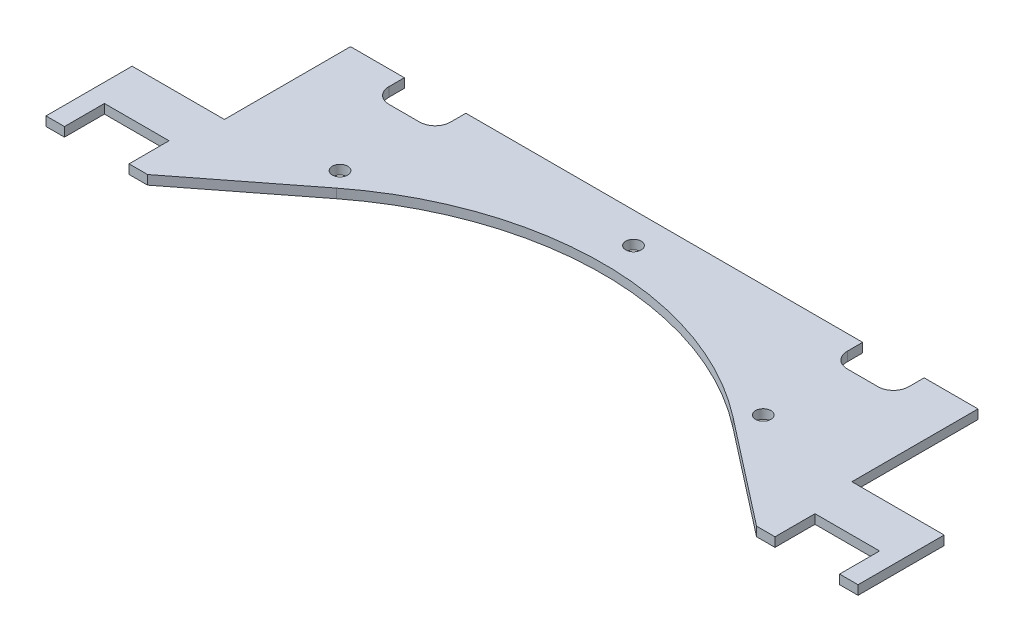
ISO-10303-21;
HEADER;
FILE_DESCRIPTION(('STEP AP214'),'2;1');
FILE_NAME('part.step','',(''),(''),'','','');
FILE_SCHEMA(('AUTOMOTIVE_DESIGN { 1 0 10303 214 1 1 1 1 }'));
ENDSEC;
DATA;
#1=APPLICATION_CONTEXT('core data for automotive mechanical design processes');
#2=APPLICATION_PROTOCOL_DEFINITION('international standard','automotive_design',2000,#1);
#3=PRODUCT_CONTEXT('',#1,'mechanical');
#4=PRODUCT('Part','Part','',(#3));
#5=PRODUCT_RELATED_PRODUCT_CATEGORY('part','',(#4));
#6=PRODUCT_DEFINITION_FORMATION('','',#4);
#7=PRODUCT_DEFINITION_CONTEXT('part definition',#1,'design');
#8=PRODUCT_DEFINITION('design','',#6,#7);
#9=PRODUCT_DEFINITION_SHAPE('','',#8);
#10=(LENGTH_UNIT() NAMED_UNIT(*) SI_UNIT(.MILLI.,.METRE.));
#11=(NAMED_UNIT(*) PLANE_ANGLE_UNIT() SI_UNIT($,.RADIAN.));
#12=(NAMED_UNIT(*) SI_UNIT($,.STERADIAN.) SOLID_ANGLE_UNIT());
#13=UNCERTAINTY_MEASURE_WITH_UNIT(LENGTH_MEASURE(1.E-05),#10,'distance_accuracy_value','');
#14=(GEOMETRIC_REPRESENTATION_CONTEXT(3) GLOBAL_UNCERTAINTY_ASSIGNED_CONTEXT((#13)) GLOBAL_UNIT_ASSIGNED_CONTEXT((#10,
#11,#12)) REPRESENTATION_CONTEXT('',''));
#15=CARTESIAN_POINT('',(0.,0.,0.));
#16=DIRECTION('',(0.,0.,1.));
#17=DIRECTION('',(1.,0.,0.));
#18=AXIS2_PLACEMENT_3D('',#15,#16,#17);
#19=CARTESIAN_POINT('',(0.,3.,30.));
#20=DIRECTION('',(0.,1.,0.));
#21=DIRECTION('',(0.,0.,1.));
#22=AXIS2_PLACEMENT_3D('',#19,#20,#21);
#23=PLANE('',#22);
#24=CARTESIAN_POINT('',(68.7939924130601,3.,-58.3820491269117));
#25=DIRECTION('',(0.,1.,0.));
#26=DIRECTION('',(0.,0.,-1.));
#27=AXIS2_PLACEMENT_3D('',#24,#25,#26);
#28=CIRCLE('',#27,2.50000000000001);
#29=CARTESIAN_POINT('',(68.7939924130601,3.,-60.8820491269117));
#30=VERTEX_POINT('',#29);
#31=EDGE_CURVE('E545',#30,#30,#28,.T.);
#32=ORIENTED_EDGE('',*,*,#31,.F.);
#33=EDGE_LOOP('',(#32));
#34=FACE_BOUND('',#33,.T.);
#35=CARTESIAN_POINT('',(0.,3.,30.));
#36=DIRECTION('',(0.,-1.,0.));
#37=DIRECTION('',(0.,0.,1.));
#38=AXIS2_PLACEMENT_3D('',#35,#36,#37);
#39=CIRCLE('',#38,105.);
#40=CARTESIAN_POINT('',(-64.4943678872438,3.,-52.8581710564798));
#41=VERTEX_POINT('',#40);
#42=CARTESIAN_POINT('',(64.4943678872438,3.,-52.8581710564798));
#43=VERTEX_POINT('',#42);
#44=EDGE_CURVE('E335',#41,#43,#39,.T.);
#45=ORIENTED_EDGE('',*,*,#44,.T.);
#46=DIRECTION('',(0.78912543863314,0.,0.614232075116607));
#47=VECTOR('',#46,1.);
#48=CARTESIAN_POINT('',(64.4943678872438,3.,-52.8581710564798));
#49=LINE('',#48,#47);
#50=CARTESIAN_POINT('',(99.,3.,-26.));
#51=VERTEX_POINT('',#50);
#52=EDGE_CURVE('E163',#43,#51,#49,.T.);
#53=ORIENTED_EDGE('',*,*,#52,.T.);
#54=DIRECTION('',(1.,0.,0.));
#55=VECTOR('',#54,1.);
#56=CARTESIAN_POINT('',(105.,3.,-26.));
#57=LINE('',#56,#55);
#58=CARTESIAN_POINT('',(105.,3.,-26.));
#59=VERTEX_POINT('',#58);
#60=EDGE_CURVE('E422',#51,#59,#57,.T.);
#61=ORIENTED_EDGE('',*,*,#60,.T.);
#62=DIRECTION('',(0.,0.,-1.));
#63=VECTOR('',#62,1.);
#64=CARTESIAN_POINT('',(105.,3.,-39.));
#65=LINE('',#64,#63);
#66=CARTESIAN_POINT('',(105.,3.,-39.));
#67=VERTEX_POINT('',#66);
#68=EDGE_CURVE('E441',#59,#67,#65,.T.);
#69=ORIENTED_EDGE('',*,*,#68,.T.);
#70=DIRECTION('',(1.,0.,0.));
#71=VECTOR('',#70,1.);
#72=CARTESIAN_POINT('',(126.,3.,-39.));
#73=LINE('',#72,#71);
#74=CARTESIAN_POINT('',(126.,3.,-39.));
#75=VERTEX_POINT('',#74);
#76=EDGE_CURVE('E438',#67,#75,#73,.T.);
#77=ORIENTED_EDGE('',*,*,#76,.T.);
#78=DIRECTION('',(0.,0.,1.));
#79=VECTOR('',#78,1.);
#80=CARTESIAN_POINT('',(126.,3.,-26.));
#81=LINE('',#80,#79);
#82=CARTESIAN_POINT('',(126.,3.,-26.));
#83=VERTEX_POINT('',#82);
#84=EDGE_CURVE('E440',#75,#83,#81,.T.);
#85=ORIENTED_EDGE('',*,*,#84,.T.);
#86=DIRECTION('',(1.,0.,0.));
#87=VECTOR('',#86,1.);
#88=CARTESIAN_POINT('',(132.,3.,-26.));
#89=LINE('',#88,#87);
#90=CARTESIAN_POINT('',(132.,3.,-26.));
#91=VERTEX_POINT('',#90);
#92=EDGE_CURVE('E443',#83,#91,#89,.T.);
#93=ORIENTED_EDGE('',*,*,#92,.T.);
#94=DIRECTION('',(0.,0.,-1.));
#95=VECTOR('',#94,1.);
#96=CARTESIAN_POINT('',(132.,3.,-26.));
#97=LINE('',#96,#95);
#98=CARTESIAN_POINT('',(132.,3.,-54.));
#99=VERTEX_POINT('',#98);
#100=EDGE_CURVE('E449',#91,#99,#97,.T.);
#101=ORIENTED_EDGE('',*,*,#100,.T.);
#102=DIRECTION('',(-1.,0.,0.));
#103=VECTOR('',#102,1.);
#104=CARTESIAN_POINT('',(132.,3.,-54.));
#105=LINE('',#104,#103);
#106=CARTESIAN_POINT('',(102.,3.,-54.));
#107=VERTEX_POINT('',#106);
#108=EDGE_CURVE('E451',#99,#107,#105,.T.);
#109=ORIENTED_EDGE('',*,*,#108,.T.);
#110=DIRECTION('',(0.,0.,-1.));
#111=VECTOR('',#110,1.);
#112=CARTESIAN_POINT('',(102.,3.,-54.));
#113=LINE('',#112,#111);
#114=CARTESIAN_POINT('',(102.,3.,-95.));
#115=VERTEX_POINT('',#114);
#116=EDGE_CURVE('E453',#107,#115,#113,.T.);
#117=ORIENTED_EDGE('',*,*,#116,.T.);
#118=DIRECTION('',(-1.,0.,0.));
#119=VECTOR('',#118,1.);
#120=CARTESIAN_POINT('',(102.,3.,-95.));
#121=LINE('',#120,#119);
#122=CARTESIAN_POINT('',(84.5,3.,-95.));
#123=VERTEX_POINT('',#122);
#124=EDGE_CURVE('E455',#115,#123,#121,.T.);
#125=ORIENTED_EDGE('',*,*,#124,.T.);
#126=DIRECTION('',(0.,0.,1.));
#127=VECTOR('',#126,1.);
#128=CARTESIAN_POINT('',(84.5,3.,-95.));
#129=LINE('',#128,#127);
#130=CARTESIAN_POINT('',(84.5,3.,-90.));
#131=VERTEX_POINT('',#130);
#132=EDGE_CURVE('E457',#123,#131,#129,.T.);
#133=ORIENTED_EDGE('',*,*,#132,.T.);
#134=CARTESIAN_POINT('',(79.5,3.,-90.));
#135=DIRECTION('',(0.,-1.,0.));
#136=DIRECTION('',(0.,0.,-1.));
#137=AXIS2_PLACEMENT_3D('',#134,#135,#136);
#138=CIRCLE('',#137,5.);
#139=CARTESIAN_POINT('',(79.5,3.,-85.));
#140=VERTEX_POINT('',#139);
#141=EDGE_CURVE('E459',#131,#140,#138,.T.);
#142=ORIENTED_EDGE('',*,*,#141,.T.);
#143=DIRECTION('',(-1.,0.,0.));
#144=VECTOR('',#143,1.);
#145=CARTESIAN_POINT('',(79.5,3.,-85.));
#146=LINE('',#145,#144);
#147=CARTESIAN_POINT('',(69.5,3.,-85.));
#148=VERTEX_POINT('',#147);
#149=EDGE_CURVE('E461',#140,#148,#146,.T.);
#150=ORIENTED_EDGE('',*,*,#149,.T.);
#151=CARTESIAN_POINT('',(69.5,3.,-90.));
#152=DIRECTION('',(0.,-1.,0.));
#153=DIRECTION('',(0.,0.,-1.));
#154=AXIS2_PLACEMENT_3D('',#151,#152,#153);
#155=CIRCLE('',#154,5.);
#156=CARTESIAN_POINT('',(64.5,3.,-90.));
#157=VERTEX_POINT('',#156);
#158=EDGE_CURVE('E463',#148,#157,#155,.T.);
#159=ORIENTED_EDGE('',*,*,#158,.T.);
#160=DIRECTION('',(0.,0.,-1.));
#161=VECTOR('',#160,1.);
#162=CARTESIAN_POINT('',(64.5,3.,-95.));
#163=LINE('',#162,#161);
#164=CARTESIAN_POINT('',(64.5,3.,-95.));
#165=VERTEX_POINT('',#164);
#166=EDGE_CURVE('E465',#157,#165,#163,.T.);
#167=ORIENTED_EDGE('',*,*,#166,.T.);
#168=DIRECTION('',(-1.,0.,0.));
#169=VECTOR('',#168,1.);
#170=CARTESIAN_POINT('',(-64.5,3.,-95.));
#171=LINE('',#170,#169);
#172=CARTESIAN_POINT('',(-64.5,3.,-95.));
#173=VERTEX_POINT('',#172);
#174=EDGE_CURVE('E467',#165,#173,#171,.T.);
#175=ORIENTED_EDGE('',*,*,#174,.T.);
#176=DIRECTION('',(0.,0.,1.));
#177=VECTOR('',#176,1.);
#178=CARTESIAN_POINT('',(-64.5,3.,-95.));
#179=LINE('',#178,#177);
#180=CARTESIAN_POINT('',(-64.5,3.,-90.));
#181=VERTEX_POINT('',#180);
#182=EDGE_CURVE('E469',#173,#181,#179,.T.);
#183=ORIENTED_EDGE('',*,*,#182,.T.);
#184=CARTESIAN_POINT('',(-69.5,3.,-90.));
#185=DIRECTION('',(0.,-1.,0.));
#186=DIRECTION('',(0.,0.,1.));
#187=AXIS2_PLACEMENT_3D('',#184,#185,#186);
#188=CIRCLE('',#187,5.);
#189=CARTESIAN_POINT('',(-69.5,3.,-85.));
#190=VERTEX_POINT('',#189);
#191=EDGE_CURVE('E471',#181,#190,#188,.T.);
#192=ORIENTED_EDGE('',*,*,#191,.T.);
#193=DIRECTION('',(-1.,0.,0.));
#194=VECTOR('',#193,1.);
#195=CARTESIAN_POINT('',(-79.5,3.,-85.));
#196=LINE('',#195,#194);
#197=CARTESIAN_POINT('',(-79.5,3.,-85.));
#198=VERTEX_POINT('',#197);
#199=EDGE_CURVE('E473',#190,#198,#196,.T.);
#200=ORIENTED_EDGE('',*,*,#199,.T.);
#201=CARTESIAN_POINT('',(-79.5,3.,-90.));
#202=DIRECTION('',(0.,-1.,0.));
#203=DIRECTION('',(0.,0.,1.));
#204=AXIS2_PLACEMENT_3D('',#201,#202,#203);
#205=CIRCLE('',#204,5.);
#206=CARTESIAN_POINT('',(-84.5,3.,-90.));
#207=VERTEX_POINT('',#206);
#208=EDGE_CURVE('E475',#198,#207,#205,.T.);
#209=ORIENTED_EDGE('',*,*,#208,.T.);
#210=DIRECTION('',(0.,0.,-1.));
#211=VECTOR('',#210,1.);
#212=CARTESIAN_POINT('',(-84.5,3.,-95.));
#213=LINE('',#212,#211);
#214=CARTESIAN_POINT('',(-84.5,3.,-95.));
#215=VERTEX_POINT('',#214);
#216=EDGE_CURVE('E477',#207,#215,#213,.T.);
#217=ORIENTED_EDGE('',*,*,#216,.T.);
#218=DIRECTION('',(-1.,0.,0.));
#219=VECTOR('',#218,1.);
#220=CARTESIAN_POINT('',(-102.,3.,-95.));
#221=LINE('',#220,#219);
#222=CARTESIAN_POINT('',(-102.,3.,-95.));
#223=VERTEX_POINT('',#222);
#224=EDGE_CURVE('E479',#215,#223,#221,.T.);
#225=ORIENTED_EDGE('',*,*,#224,.T.);
#226=DIRECTION('',(0.,0.,1.));
#227=VECTOR('',#226,1.);
#228=CARTESIAN_POINT('',(-102.,3.,-54.));
#229=LINE('',#228,#227);
#230=CARTESIAN_POINT('',(-102.,3.,-54.));
#231=VERTEX_POINT('',#230);
#232=EDGE_CURVE('E481',#223,#231,#229,.T.);
#233=ORIENTED_EDGE('',*,*,#232,.T.);
#234=DIRECTION('',(-1.,0.,0.));
#235=VECTOR('',#234,1.);
#236=CARTESIAN_POINT('',(-132.,3.,-54.));
#237=LINE('',#236,#235);
#238=CARTESIAN_POINT('',(-132.,3.,-54.));
#239=VERTEX_POINT('',#238);
#240=EDGE_CURVE('E483',#231,#239,#237,.T.);
#241=ORIENTED_EDGE('',*,*,#240,.T.);
#242=DIRECTION('',(0.,0.,1.));
#243=VECTOR('',#242,1.);
#244=CARTESIAN_POINT('',(-132.,3.,-26.));
#245=LINE('',#244,#243);
#246=CARTESIAN_POINT('',(-132.,3.,-26.));
#247=VERTEX_POINT('',#246);
#248=EDGE_CURVE('E485',#239,#247,#245,.T.);
#249=ORIENTED_EDGE('',*,*,#248,.T.);
#250=DIRECTION('',(1.,0.,0.));
#251=VECTOR('',#250,1.);
#252=CARTESIAN_POINT('',(-132.,3.,-26.));
#253=LINE('',#252,#251);
#254=CARTESIAN_POINT('',(-126.,3.,-26.));
#255=VERTEX_POINT('',#254);
#256=EDGE_CURVE('E487',#247,#255,#253,.T.);
#257=ORIENTED_EDGE('',*,*,#256,.T.);
#258=DIRECTION('',(0.,0.,-1.));
#259=VECTOR('',#258,1.);
#260=CARTESIAN_POINT('',(-126.,3.,-26.));
#261=LINE('',#260,#259);
#262=CARTESIAN_POINT('',(-126.,3.,-39.));
#263=VERTEX_POINT('',#262);
#264=EDGE_CURVE('E489',#255,#263,#261,.T.);
#265=ORIENTED_EDGE('',*,*,#264,.T.);
#266=DIRECTION('',(1.,0.,0.));
#267=VECTOR('',#266,1.);
#268=CARTESIAN_POINT('',(-126.,3.,-39.));
#269=LINE('',#268,#267);
#270=CARTESIAN_POINT('',(-105.,3.,-39.));
#271=VERTEX_POINT('',#270);
#272=EDGE_CURVE('E254',#263,#271,#269,.T.);
#273=ORIENTED_EDGE('',*,*,#272,.T.);
#274=DIRECTION('',(0.,0.,1.));
#275=VECTOR('',#274,1.);
#276=CARTESIAN_POINT('',(-105.,3.,-39.));
#277=LINE('',#276,#275);
#278=CARTESIAN_POINT('',(-105.,3.,-26.));
#279=VERTEX_POINT('',#278);
#280=EDGE_CURVE('E248',#271,#279,#277,.T.);
#281=ORIENTED_EDGE('',*,*,#280,.T.);
#282=DIRECTION('',(1.,0.,0.));
#283=VECTOR('',#282,1.);
#284=CARTESIAN_POINT('',(-105.,3.,-26.));
#285=LINE('',#284,#283);
#286=CARTESIAN_POINT('',(-99.,3.,-26.));
#287=VERTEX_POINT('',#286);
#288=EDGE_CURVE('E252',#279,#287,#285,.T.);
#289=ORIENTED_EDGE('',*,*,#288,.T.);
#290=DIRECTION('',(0.78912543863314,0.,-0.614232075116607));
#291=VECTOR('',#290,1.);
#292=CARTESIAN_POINT('',(-64.4943678872438,3.,-52.8581710564798));
#293=LINE('',#292,#291);
#294=EDGE_CURVE('E48',#287,#41,#293,.T.);
#295=ORIENTED_EDGE('',*,*,#294,.T.);
#296=EDGE_LOOP('',(#45,#53,#61,#69,#77,#85,#93,#101,#109,#117,#125,#133,#142,#150,#159,#167,
#175,#183,#192,#200,#209,#217,#225,#233,#241,#249,#257,#265,#273,#281,#289,#295));
#297=FACE_BOUND('',#296,.T.);
#298=CARTESIAN_POINT('',(-68.7939924130601,3.,-58.3820491269117));
#299=DIRECTION('',(0.,1.,0.));
#300=DIRECTION('',(0.,0.,1.));
#301=AXIS2_PLACEMENT_3D('',#298,#299,#300);
#302=CIRCLE('',#301,2.50000000000001);
#303=CARTESIAN_POINT('',(-68.7939924130601,3.,-55.8820491269117));
#304=VERTEX_POINT('',#303);
#305=EDGE_CURVE('E276',#304,#304,#302,.T.);
#306=ORIENTED_EDGE('',*,*,#305,.F.);
#307=EDGE_LOOP('',(#306));
#308=FACE_BOUND('',#307,.T.);
#309=CARTESIAN_POINT('',(0.,3.,-85.));
#310=DIRECTION('',(0.,1.,0.));
#311=DIRECTION('',(0.,0.,1.));
#312=AXIS2_PLACEMENT_3D('',#309,#310,#311);
#313=CIRCLE('',#312,2.5);
#314=CARTESIAN_POINT('',(0.,3.,-82.5));
#315=VERTEX_POINT('',#314);
#316=EDGE_CURVE('E536',#315,#315,#313,.T.);
#317=ORIENTED_EDGE('',*,*,#316,.F.);
#318=EDGE_LOOP('',(#317));
#319=FACE_BOUND('',#318,.T.);
#320=ADVANCED_FACE('F31',(#34,#297,#308,#319),#23,.T.);
#321=CARTESIAN_POINT('',(0.,0.,30.));
#322=DIRECTION('',(0.,1.,0.));
#323=DIRECTION('',(0.,0.,1.));
#324=AXIS2_PLACEMENT_3D('',#321,#322,#323);
#325=PLANE('',#324);
#326=CARTESIAN_POINT('',(68.7939924130601,0.,-58.3820491269117));
#327=DIRECTION('',(0.,1.,0.));
#328=DIRECTION('',(0.,0.,-1.));
#329=AXIS2_PLACEMENT_3D('',#326,#327,#328);
#330=CIRCLE('',#329,2.50000000000001);
#331=CARTESIAN_POINT('',(68.7939924130601,0.,-60.8820491269117));
#332=VERTEX_POINT('',#331);
#333=EDGE_CURVE('E542',#332,#332,#330,.T.);
#334=ORIENTED_EDGE('',*,*,#333,.T.);
#335=EDGE_LOOP('',(#334));
#336=FACE_BOUND('',#335,.T.);
#337=CARTESIAN_POINT('',(0.,0.,30.));
#338=DIRECTION('',(0.,-1.,0.));
#339=DIRECTION('',(0.,0.,1.));
#340=AXIS2_PLACEMENT_3D('',#337,#338,#339);
#341=CIRCLE('',#340,105.);
#342=CARTESIAN_POINT('',(-64.4943678872438,0.,-52.8581710564798));
#343=VERTEX_POINT('',#342);
#344=CARTESIAN_POINT('',(64.4943678872438,0.,-52.8581710564798));
#345=VERTEX_POINT('',#344);
#346=EDGE_CURVE('E272',#343,#345,#341,.T.);
#347=ORIENTED_EDGE('',*,*,#346,.F.);
#348=DIRECTION('',(0.78912543863314,0.,-0.614232075116607));
#349=VECTOR('',#348,1.);
#350=CARTESIAN_POINT('',(-64.4943678872438,0.,-52.8581710564798));
#351=LINE('',#350,#349);
#352=CARTESIAN_POINT('',(-99.,0.,-26.));
#353=VERTEX_POINT('',#352);
#354=EDGE_CURVE('E155',#353,#343,#351,.T.);
#355=ORIENTED_EDGE('',*,*,#354,.F.);
#356=DIRECTION('',(1.,0.,0.));
#357=VECTOR('',#356,1.);
#358=CARTESIAN_POINT('',(-105.,0.,-26.));
#359=LINE('',#358,#357);
#360=CARTESIAN_POINT('',(-105.,0.,-26.));
#361=VERTEX_POINT('',#360);
#362=EDGE_CURVE('E149',#361,#353,#359,.T.);
#363=ORIENTED_EDGE('',*,*,#362,.F.);
#364=DIRECTION('',(0.,0.,1.));
#365=VECTOR('',#364,1.);
#366=CARTESIAN_POINT('',(-105.,0.,-39.));
#367=LINE('',#366,#365);
#368=CARTESIAN_POINT('',(-105.,0.,-39.));
#369=VERTEX_POINT('',#368);
#370=EDGE_CURVE('E262',#369,#361,#367,.T.);
#371=ORIENTED_EDGE('',*,*,#370,.F.);
#372=DIRECTION('',(1.,0.,0.));
#373=VECTOR('',#372,1.);
#374=CARTESIAN_POINT('',(-126.,0.,-39.));
#375=LINE('',#374,#373);
#376=CARTESIAN_POINT('',(-126.,0.,-39.));
#377=VERTEX_POINT('',#376);
#378=EDGE_CURVE('E330',#377,#369,#375,.T.);
#379=ORIENTED_EDGE('',*,*,#378,.F.);
#380=DIRECTION('',(0.,0.,-1.));
#381=VECTOR('',#380,1.);
#382=CARTESIAN_POINT('',(-126.,0.,-26.));
#383=LINE('',#382,#381);
#384=CARTESIAN_POINT('',(-126.,0.,-26.));
#385=VERTEX_POINT('',#384);
#386=EDGE_CURVE('E328',#385,#377,#383,.T.);
#387=ORIENTED_EDGE('',*,*,#386,.F.);
#388=DIRECTION('',(1.,0.,0.));
#389=VECTOR('',#388,1.);
#390=CARTESIAN_POINT('',(-132.,0.,-26.));
#391=LINE('',#390,#389);
#392=CARTESIAN_POINT('',(-132.,0.,-26.));
#393=VERTEX_POINT('',#392);
#394=EDGE_CURVE('E326',#393,#385,#391,.T.);
#395=ORIENTED_EDGE('',*,*,#394,.F.);
#396=DIRECTION('',(0.,0.,1.));
#397=VECTOR('',#396,1.);
#398=CARTESIAN_POINT('',(-132.,0.,-26.));
#399=LINE('',#398,#397);
#400=CARTESIAN_POINT('',(-132.,0.,-54.));
#401=VERTEX_POINT('',#400);
#402=EDGE_CURVE('E324',#401,#393,#399,.T.);
#403=ORIENTED_EDGE('',*,*,#402,.F.);
#404=DIRECTION('',(-1.,0.,0.));
#405=VECTOR('',#404,1.);
#406=CARTESIAN_POINT('',(-132.,0.,-54.));
#407=LINE('',#406,#405);
#408=CARTESIAN_POINT('',(-102.,0.,-54.));
#409=VERTEX_POINT('',#408);
#410=EDGE_CURVE('E322',#409,#401,#407,.T.);
#411=ORIENTED_EDGE('',*,*,#410,.F.);
#412=DIRECTION('',(0.,0.,1.));
#413=VECTOR('',#412,1.);
#414=CARTESIAN_POINT('',(-102.,0.,-54.));
#415=LINE('',#414,#413);
#416=CARTESIAN_POINT('',(-102.,0.,-95.));
#417=VERTEX_POINT('',#416);
#418=EDGE_CURVE('E320',#417,#409,#415,.T.);
#419=ORIENTED_EDGE('',*,*,#418,.F.);
#420=DIRECTION('',(-1.,0.,0.));
#421=VECTOR('',#420,1.);
#422=CARTESIAN_POINT('',(-102.,0.,-95.));
#423=LINE('',#422,#421);
#424=CARTESIAN_POINT('',(-84.5,0.,-95.));
#425=VERTEX_POINT('',#424);
#426=EDGE_CURVE('E318',#425,#417,#423,.T.);
#427=ORIENTED_EDGE('',*,*,#426,.F.);
#428=DIRECTION('',(0.,0.,-1.));
#429=VECTOR('',#428,1.);
#430=CARTESIAN_POINT('',(-84.5,0.,-95.));
#431=LINE('',#430,#429);
#432=CARTESIAN_POINT('',(-84.5,0.,-90.));
#433=VERTEX_POINT('',#432);
#434=EDGE_CURVE('E316',#433,#425,#431,.T.);
#435=ORIENTED_EDGE('',*,*,#434,.F.);
#436=CARTESIAN_POINT('',(-79.5,0.,-90.));
#437=DIRECTION('',(0.,-1.,0.));
#438=DIRECTION('',(0.,0.,1.));
#439=AXIS2_PLACEMENT_3D('',#436,#437,#438);
#440=CIRCLE('',#439,5.);
#441=CARTESIAN_POINT('',(-79.5,0.,-85.));
#442=VERTEX_POINT('',#441);
#443=EDGE_CURVE('E314',#442,#433,#440,.T.);
#444=ORIENTED_EDGE('',*,*,#443,.F.);
#445=DIRECTION('',(-1.,0.,0.));
#446=VECTOR('',#445,1.);
#447=CARTESIAN_POINT('',(-79.5,0.,-85.));
#448=LINE('',#447,#446);
#449=CARTESIAN_POINT('',(-69.5,0.,-85.));
#450=VERTEX_POINT('',#449);
#451=EDGE_CURVE('E312',#450,#442,#448,.T.);
#452=ORIENTED_EDGE('',*,*,#451,.F.);
#453=CARTESIAN_POINT('',(-69.5,0.,-90.));
#454=DIRECTION('',(0.,-1.,0.));
#455=DIRECTION('',(0.,0.,1.));
#456=AXIS2_PLACEMENT_3D('',#453,#454,#455);
#457=CIRCLE('',#456,5.);
#458=CARTESIAN_POINT('',(-64.5,0.,-90.));
#459=VERTEX_POINT('',#458);
#460=EDGE_CURVE('E310',#459,#450,#457,.T.);
#461=ORIENTED_EDGE('',*,*,#460,.F.);
#462=DIRECTION('',(0.,0.,1.));
#463=VECTOR('',#462,1.);
#464=CARTESIAN_POINT('',(-64.5,0.,-95.));
#465=LINE('',#464,#463);
#466=CARTESIAN_POINT('',(-64.5,0.,-95.));
#467=VERTEX_POINT('',#466);
#468=EDGE_CURVE('E308',#467,#459,#465,.T.);
#469=ORIENTED_EDGE('',*,*,#468,.F.);
#470=DIRECTION('',(-1.,0.,0.));
#471=VECTOR('',#470,1.);
#472=CARTESIAN_POINT('',(-64.5,0.,-95.));
#473=LINE('',#472,#471);
#474=CARTESIAN_POINT('',(64.5,0.,-95.));
#475=VERTEX_POINT('',#474);
#476=EDGE_CURVE('E306',#475,#467,#473,.T.);
#477=ORIENTED_EDGE('',*,*,#476,.F.);
#478=DIRECTION('',(0.,0.,-1.));
#479=VECTOR('',#478,1.);
#480=CARTESIAN_POINT('',(64.5,0.,-95.));
#481=LINE('',#480,#479);
#482=CARTESIAN_POINT('',(64.5,0.,-90.));
#483=VERTEX_POINT('',#482);
#484=EDGE_CURVE('E304',#483,#475,#481,.T.);
#485=ORIENTED_EDGE('',*,*,#484,.F.);
#486=CARTESIAN_POINT('',(69.5,0.,-90.));
#487=DIRECTION('',(0.,-1.,0.));
#488=DIRECTION('',(0.,0.,-1.));
#489=AXIS2_PLACEMENT_3D('',#486,#487,#488);
#490=CIRCLE('',#489,5.);
#491=CARTESIAN_POINT('',(69.5,0.,-85.));
#492=VERTEX_POINT('',#491);
#493=EDGE_CURVE('E302',#492,#483,#490,.T.);
#494=ORIENTED_EDGE('',*,*,#493,.F.);
#495=DIRECTION('',(-1.,0.,0.));
#496=VECTOR('',#495,1.);
#497=CARTESIAN_POINT('',(79.5,0.,-85.));
#498=LINE('',#497,#496);
#499=CARTESIAN_POINT('',(79.5,0.,-85.));
#500=VERTEX_POINT('',#499);
#501=EDGE_CURVE('E300',#500,#492,#498,.T.);
#502=ORIENTED_EDGE('',*,*,#501,.F.);
#503=CARTESIAN_POINT('',(79.5,0.,-90.));
#504=DIRECTION('',(0.,-1.,0.));
#505=DIRECTION('',(0.,0.,-1.));
#506=AXIS2_PLACEMENT_3D('',#503,#504,#505);
#507=CIRCLE('',#506,5.);
#508=CARTESIAN_POINT('',(84.5,0.,-90.));
#509=VERTEX_POINT('',#508);
#510=EDGE_CURVE('E298',#509,#500,#507,.T.);
#511=ORIENTED_EDGE('',*,*,#510,.F.);
#512=DIRECTION('',(0.,0.,1.));
#513=VECTOR('',#512,1.);
#514=CARTESIAN_POINT('',(84.5,0.,-95.));
#515=LINE('',#514,#513);
#516=CARTESIAN_POINT('',(84.5,0.,-95.));
#517=VERTEX_POINT('',#516);
#518=EDGE_CURVE('E296',#517,#509,#515,.T.);
#519=ORIENTED_EDGE('',*,*,#518,.F.);
#520=DIRECTION('',(-1.,0.,0.));
#521=VECTOR('',#520,1.);
#522=CARTESIAN_POINT('',(102.,0.,-95.));
#523=LINE('',#522,#521);
#524=CARTESIAN_POINT('',(102.,0.,-95.));
#525=VERTEX_POINT('',#524);
#526=EDGE_CURVE('E294',#525,#517,#523,.T.);
#527=ORIENTED_EDGE('',*,*,#526,.F.);
#528=DIRECTION('',(0.,0.,-1.));
#529=VECTOR('',#528,1.);
#530=CARTESIAN_POINT('',(102.,0.,-54.));
#531=LINE('',#530,#529);
#532=CARTESIAN_POINT('',(102.,0.,-54.));
#533=VERTEX_POINT('',#532);
#534=EDGE_CURVE('E292',#533,#525,#531,.T.);
#535=ORIENTED_EDGE('',*,*,#534,.F.);
#536=DIRECTION('',(-1.,0.,0.));
#537=VECTOR('',#536,1.);
#538=CARTESIAN_POINT('',(132.,0.,-54.));
#539=LINE('',#538,#537);
#540=CARTESIAN_POINT('',(132.,0.,-54.));
#541=VERTEX_POINT('',#540);
#542=EDGE_CURVE('E290',#541,#533,#539,.T.);
#543=ORIENTED_EDGE('',*,*,#542,.F.);
#544=DIRECTION('',(0.,0.,-1.));
#545=VECTOR('',#544,1.);
#546=CARTESIAN_POINT('',(132.,0.,-26.));
#547=LINE('',#546,#545);
#548=CARTESIAN_POINT('',(132.,0.,-26.));
#549=VERTEX_POINT('',#548);
#550=EDGE_CURVE('E288',#549,#541,#547,.T.);
#551=ORIENTED_EDGE('',*,*,#550,.F.);
#552=DIRECTION('',(1.,0.,0.));
#553=VECTOR('',#552,1.);
#554=CARTESIAN_POINT('',(132.,0.,-26.));
#555=LINE('',#554,#553);
#556=CARTESIAN_POINT('',(126.,0.,-26.));
#557=VERTEX_POINT('',#556);
#558=EDGE_CURVE('E286',#557,#549,#555,.T.);
#559=ORIENTED_EDGE('',*,*,#558,.F.);
#560=DIRECTION('',(0.,0.,1.));
#561=VECTOR('',#560,1.);
#562=CARTESIAN_POINT('',(126.,0.,-26.));
#563=LINE('',#562,#561);
#564=CARTESIAN_POINT('',(126.,0.,-39.));
#565=VERTEX_POINT('',#564);
#566=EDGE_CURVE('E284',#565,#557,#563,.T.);
#567=ORIENTED_EDGE('',*,*,#566,.F.);
#568=DIRECTION('',(1.,0.,0.));
#569=VECTOR('',#568,1.);
#570=CARTESIAN_POINT('',(126.,0.,-39.));
#571=LINE('',#570,#569);
#572=CARTESIAN_POINT('',(105.,0.,-39.));
#573=VERTEX_POINT('',#572);
#574=EDGE_CURVE('E282',#573,#565,#571,.T.);
#575=ORIENTED_EDGE('',*,*,#574,.F.);
#576=DIRECTION('',(0.,0.,-1.));
#577=VECTOR('',#576,1.);
#578=CARTESIAN_POINT('',(105.,0.,-39.));
#579=LINE('',#578,#577);
#580=CARTESIAN_POINT('',(105.,0.,-26.));
#581=VERTEX_POINT('',#580);
#582=EDGE_CURVE('E280',#581,#573,#579,.T.);
#583=ORIENTED_EDGE('',*,*,#582,.F.);
#584=DIRECTION('',(1.,0.,0.));
#585=VECTOR('',#584,1.);
#586=CARTESIAN_POINT('',(105.,0.,-26.));
#587=LINE('',#586,#585);
#588=CARTESIAN_POINT('',(99.,0.,-26.));
#589=VERTEX_POINT('',#588);
#590=EDGE_CURVE('E278',#589,#581,#587,.T.);
#591=ORIENTED_EDGE('',*,*,#590,.F.);
#592=DIRECTION('',(0.78912543863314,0.,0.614232075116607));
#593=VECTOR('',#592,1.);
#594=CARTESIAN_POINT('',(64.4943678872438,0.,-52.8581710564798));
#595=LINE('',#594,#593);
#596=EDGE_CURVE('E275',#345,#589,#595,.T.);
#597=ORIENTED_EDGE('',*,*,#596,.F.);
#598=EDGE_LOOP('',(#347,#355,#363,#371,#379,#387,#395,#403,#411,#419,#427,#435,#444,#452,#461,
#469,#477,#485,#494,#502,#511,#519,#527,#535,#543,#551,#559,#567,#575,#583,#591,#597));
#599=FACE_BOUND('',#598,.T.);
#600=CARTESIAN_POINT('',(-68.7939924130601,0.,-58.3820491269117));
#601=DIRECTION('',(0.,1.,0.));
#602=DIRECTION('',(0.,0.,1.));
#603=AXIS2_PLACEMENT_3D('',#600,#601,#602);
#604=CIRCLE('',#603,2.50000000000001);
#605=CARTESIAN_POINT('',(-68.7939924130601,0.,-55.8820491269117));
#606=VERTEX_POINT('',#605);
#607=EDGE_CURVE('E548',#606,#606,#604,.T.);
#608=ORIENTED_EDGE('',*,*,#607,.T.);
#609=EDGE_LOOP('',(#608));
#610=FACE_BOUND('',#609,.T.);
#611=CARTESIAN_POINT('',(0.,0.,-85.));
#612=DIRECTION('',(0.,1.,0.));
#613=DIRECTION('',(0.,0.,1.));
#614=AXIS2_PLACEMENT_3D('',#611,#612,#613);
#615=CIRCLE('',#614,2.5);
#616=CARTESIAN_POINT('',(0.,0.,-82.5));
#617=VERTEX_POINT('',#616);
#618=EDGE_CURVE('E539',#617,#617,#615,.T.);
#619=ORIENTED_EDGE('',*,*,#618,.T.);
#620=EDGE_LOOP('',(#619));
#621=FACE_BOUND('',#620,.T.);
#622=ADVANCED_FACE('F426',(#336,#599,#610,#621),#325,.F.);
#623=CARTESIAN_POINT('',(0.,3.,30.));
#624=DIRECTION('',(0.,-1.,0.));
#625=DIRECTION('',(0.,0.,-1.));
#626=AXIS2_PLACEMENT_3D('',#623,#624,#625);
#627=CYLINDRICAL_SURFACE('',#626,105.);
#628=ORIENTED_EDGE('',*,*,#346,.T.);
#629=DIRECTION('',(0.,-1.,0.));
#630=VECTOR('',#629,1.);
#631=CARTESIAN_POINT('',(64.4943678872438,3.,-52.8581710564798));
#632=LINE('',#631,#630);
#633=EDGE_CURVE('E11',#43,#345,#632,.T.);
#634=ORIENTED_EDGE('',*,*,#633,.F.);
#635=ORIENTED_EDGE('',*,*,#44,.F.);
#636=DIRECTION('',(0.,-1.,0.));
#637=VECTOR('',#636,1.);
#638=CARTESIAN_POINT('',(-64.4943678872438,3.,-52.8581710564798));
#639=LINE('',#638,#637);
#640=EDGE_CURVE('E268',#41,#343,#639,.T.);
#641=ORIENTED_EDGE('',*,*,#640,.T.);
#642=EDGE_LOOP('',(#628,#634,#635,#641));
#643=FACE_BOUND('',#642,.T.);
#644=ADVANCED_FACE('F33',(#643),#627,.F.);
#645=CARTESIAN_POINT('',(64.4943678872438,3.,-52.8581710564798));
#646=DIRECTION('',(0.614232075116607,0.,-0.78912543863314));
#647=DIRECTION('',(-0.78912543863314,0.,-0.614232075116607));
#648=AXIS2_PLACEMENT_3D('',#645,#646,#647);
#649=PLANE('',#648);
#650=ORIENTED_EDGE('',*,*,#596,.T.);
#651=DIRECTION('',(0.,-1.,0.));
#652=VECTOR('',#651,1.);
#653=CARTESIAN_POINT('',(99.,3.,-26.));
#654=LINE('',#653,#652);
#655=EDGE_CURVE('E40',#51,#589,#654,.T.);
#656=ORIENTED_EDGE('',*,*,#655,.F.);
#657=ORIENTED_EDGE('',*,*,#52,.F.);
#658=ORIENTED_EDGE('',*,*,#633,.T.);
#659=EDGE_LOOP('',(#650,#656,#657,#658));
#660=FACE_BOUND('',#659,.T.);
#661=ADVANCED_FACE('F849',(#660),#649,.F.);
#662=CARTESIAN_POINT('',(105.,3.,-26.));
#663=DIRECTION('',(0.,0.,-1.));
#664=DIRECTION('',(-1.,0.,0.));
#665=AXIS2_PLACEMENT_3D('',#662,#663,#664);
#666=PLANE('',#665);
#667=ORIENTED_EDGE('',*,*,#590,.T.);
#668=DIRECTION('',(0.,-1.,0.));
#669=VECTOR('',#668,1.);
#670=CARTESIAN_POINT('',(105.,3.,-26.));
#671=LINE('',#670,#669);
#672=EDGE_CURVE('E414',#59,#581,#671,.T.);
#673=ORIENTED_EDGE('',*,*,#672,.F.);
#674=ORIENTED_EDGE('',*,*,#60,.F.);
#675=ORIENTED_EDGE('',*,*,#655,.T.);
#676=EDGE_LOOP('',(#667,#673,#674,#675));
#677=FACE_BOUND('',#676,.T.);
#678=ADVANCED_FACE('F420',(#677),#666,.F.);
#679=CARTESIAN_POINT('',(105.,3.,-39.));
#680=DIRECTION('',(-1.,0.,0.));
#681=DIRECTION('',(0.,0.,1.));
#682=AXIS2_PLACEMENT_3D('',#679,#680,#681);
#683=PLANE('',#682);
#684=ORIENTED_EDGE('',*,*,#582,.T.);
#685=DIRECTION('',(0.,-1.,0.));
#686=VECTOR('',#685,1.);
#687=CARTESIAN_POINT('',(105.,3.,-39.));
#688=LINE('',#687,#686);
#689=EDGE_CURVE('E411',#67,#573,#688,.T.);
#690=ORIENTED_EDGE('',*,*,#689,.F.);
#691=ORIENTED_EDGE('',*,*,#68,.F.);
#692=ORIENTED_EDGE('',*,*,#672,.T.);
#693=EDGE_LOOP('',(#684,#690,#691,#692));
#694=FACE_BOUND('',#693,.T.);
#695=ADVANCED_FACE('F432',(#694),#683,.F.);
#696=CARTESIAN_POINT('',(126.,3.,-39.));
#697=DIRECTION('',(0.,0.,-1.));
#698=DIRECTION('',(-1.,0.,0.));
#699=AXIS2_PLACEMENT_3D('',#696,#697,#698);
#700=PLANE('',#699);
#701=ORIENTED_EDGE('',*,*,#574,.T.);
#702=DIRECTION('',(0.,-1.,0.));
#703=VECTOR('',#702,1.);
#704=CARTESIAN_POINT('',(126.,3.,-39.));
#705=LINE('',#704,#703);
#706=EDGE_CURVE('E408',#75,#565,#705,.T.);
#707=ORIENTED_EDGE('',*,*,#706,.F.);
#708=ORIENTED_EDGE('',*,*,#76,.F.);
#709=ORIENTED_EDGE('',*,*,#689,.T.);
#710=EDGE_LOOP('',(#701,#707,#708,#709));
#711=FACE_BOUND('',#710,.T.);
#712=ADVANCED_FACE('F436',(#711),#700,.F.);
#713=CARTESIAN_POINT('',(126.,3.,-26.));
#714=DIRECTION('',(1.,0.,0.));
#715=DIRECTION('',(0.,0.,-1.));
#716=AXIS2_PLACEMENT_3D('',#713,#714,#715);
#717=PLANE('',#716);
#718=ORIENTED_EDGE('',*,*,#566,.T.);
#719=DIRECTION('',(0.,-1.,0.));
#720=VECTOR('',#719,1.);
#721=CARTESIAN_POINT('',(126.,3.,-26.));
#722=LINE('',#721,#720);
#723=EDGE_CURVE('E405',#83,#557,#722,.T.);
#724=ORIENTED_EDGE('',*,*,#723,.F.);
#725=ORIENTED_EDGE('',*,*,#84,.F.);
#726=ORIENTED_EDGE('',*,*,#706,.T.);
#727=EDGE_LOOP('',(#718,#724,#725,#726));
#728=FACE_BOUND('',#727,.T.);
#729=ADVANCED_FACE('F814',(#728),#717,.F.);
#730=CARTESIAN_POINT('',(132.,3.,-26.));
#731=DIRECTION('',(0.,0.,-1.));
#732=DIRECTION('',(-1.,0.,0.));
#733=AXIS2_PLACEMENT_3D('',#730,#731,#732);
#734=PLANE('',#733);
#735=ORIENTED_EDGE('',*,*,#558,.T.);
#736=DIRECTION('',(0.,-1.,0.));
#737=VECTOR('',#736,1.);
#738=CARTESIAN_POINT('',(132.,3.,-26.));
#739=LINE('',#738,#737);
#740=EDGE_CURVE('E402',#91,#549,#739,.T.);
#741=ORIENTED_EDGE('',*,*,#740,.F.);
#742=ORIENTED_EDGE('',*,*,#92,.F.);
#743=ORIENTED_EDGE('',*,*,#723,.T.);
#744=EDGE_LOOP('',(#735,#741,#742,#743));
#745=FACE_BOUND('',#744,.T.);
#746=ADVANCED_FACE('F804',(#745),#734,.F.);
#747=CARTESIAN_POINT('',(132.,3.,-26.));
#748=DIRECTION('',(-1.,0.,0.));
#749=DIRECTION('',(0.,0.,1.));
#750=AXIS2_PLACEMENT_3D('',#747,#748,#749);
#751=PLANE('',#750);
#752=ORIENTED_EDGE('',*,*,#550,.T.);
#753=DIRECTION('',(0.,-1.,0.));
#754=VECTOR('',#753,1.);
#755=CARTESIAN_POINT('',(132.,3.,-54.));
#756=LINE('',#755,#754);
#757=EDGE_CURVE('E399',#99,#541,#756,.T.);
#758=ORIENTED_EDGE('',*,*,#757,.F.);
#759=ORIENTED_EDGE('',*,*,#100,.F.);
#760=ORIENTED_EDGE('',*,*,#740,.T.);
#761=EDGE_LOOP('',(#752,#758,#759,#760));
#762=FACE_BOUND('',#761,.T.);
#763=ADVANCED_FACE('F794',(#762),#751,.F.);
#764=CARTESIAN_POINT('',(132.,3.,-54.));
#765=DIRECTION('',(0.,0.,1.));
#766=DIRECTION('',(1.,0.,0.));
#767=AXIS2_PLACEMENT_3D('',#764,#765,#766);
#768=PLANE('',#767);
#769=ORIENTED_EDGE('',*,*,#542,.T.);
#770=DIRECTION('',(0.,-1.,0.));
#771=VECTOR('',#770,1.);
#772=CARTESIAN_POINT('',(102.,3.,-54.));
#773=LINE('',#772,#771);
#774=EDGE_CURVE('E396',#107,#533,#773,.T.);
#775=ORIENTED_EDGE('',*,*,#774,.F.);
#776=ORIENTED_EDGE('',*,*,#108,.F.);
#777=ORIENTED_EDGE('',*,*,#757,.T.);
#778=EDGE_LOOP('',(#769,#775,#776,#777));
#779=FACE_BOUND('',#778,.T.);
#780=ADVANCED_FACE('F784',(#779),#768,.F.);
#781=CARTESIAN_POINT('',(102.,3.,-54.));
#782=DIRECTION('',(-1.,0.,0.));
#783=DIRECTION('',(0.,0.,1.));
#784=AXIS2_PLACEMENT_3D('',#781,#782,#783);
#785=PLANE('',#784);
#786=ORIENTED_EDGE('',*,*,#534,.T.);
#787=DIRECTION('',(0.,-1.,0.));
#788=VECTOR('',#787,1.);
#789=CARTESIAN_POINT('',(102.,3.,-95.));
#790=LINE('',#789,#788);
#791=EDGE_CURVE('E393',#115,#525,#790,.T.);
#792=ORIENTED_EDGE('',*,*,#791,.F.);
#793=ORIENTED_EDGE('',*,*,#116,.F.);
#794=ORIENTED_EDGE('',*,*,#774,.T.);
#795=EDGE_LOOP('',(#786,#792,#793,#794));
#796=FACE_BOUND('',#795,.T.);
#797=ADVANCED_FACE('F774',(#796),#785,.F.);
#798=CARTESIAN_POINT('',(102.,3.,-95.));
#799=DIRECTION('',(0.,0.,1.));
#800=DIRECTION('',(1.,0.,0.));
#801=AXIS2_PLACEMENT_3D('',#798,#799,#800);
#802=PLANE('',#801);
#803=ORIENTED_EDGE('',*,*,#526,.T.);
#804=DIRECTION('',(0.,-1.,0.));
#805=VECTOR('',#804,1.);
#806=CARTESIAN_POINT('',(84.5,3.,-95.));
#807=LINE('',#806,#805);
#808=EDGE_CURVE('E390',#123,#517,#807,.T.);
#809=ORIENTED_EDGE('',*,*,#808,.F.);
#810=ORIENTED_EDGE('',*,*,#124,.F.);
#811=ORIENTED_EDGE('',*,*,#791,.T.);
#812=EDGE_LOOP('',(#803,#809,#810,#811));
#813=FACE_BOUND('',#812,.T.);
#814=ADVANCED_FACE('F764',(#813),#802,.F.);
#815=CARTESIAN_POINT('',(84.5,3.,-95.));
#816=DIRECTION('',(1.,0.,0.));
#817=DIRECTION('',(0.,0.,-1.));
#818=AXIS2_PLACEMENT_3D('',#815,#816,#817);
#819=PLANE('',#818);
#820=ORIENTED_EDGE('',*,*,#518,.T.);
#821=DIRECTION('',(0.,-1.,0.));
#822=VECTOR('',#821,1.);
#823=CARTESIAN_POINT('',(84.5,3.,-90.));
#824=LINE('',#823,#822);
#825=EDGE_CURVE('E387',#131,#509,#824,.T.);
#826=ORIENTED_EDGE('',*,*,#825,.F.);
#827=ORIENTED_EDGE('',*,*,#132,.F.);
#828=ORIENTED_EDGE('',*,*,#808,.T.);
#829=EDGE_LOOP('',(#820,#826,#827,#828));
#830=FACE_BOUND('',#829,.T.);
#831=ADVANCED_FACE('F754',(#830),#819,.F.);
#832=CARTESIAN_POINT('',(79.5,3.,-90.));
#833=DIRECTION('',(0.,-1.,0.));
#834=DIRECTION('',(0.,0.,-1.));
#835=AXIS2_PLACEMENT_3D('',#832,#833,#834);
#836=CYLINDRICAL_SURFACE('',#835,5.);
#837=ORIENTED_EDGE('',*,*,#510,.T.);
#838=DIRECTION('',(0.,-1.,0.));
#839=VECTOR('',#838,1.);
#840=CARTESIAN_POINT('',(79.5,3.,-85.));
#841=LINE('',#840,#839);
#842=EDGE_CURVE('E384',#140,#500,#841,.T.);
#843=ORIENTED_EDGE('',*,*,#842,.F.);
#844=ORIENTED_EDGE('',*,*,#141,.F.);
#845=ORIENTED_EDGE('',*,*,#825,.T.);
#846=EDGE_LOOP('',(#837,#843,#844,#845));
#847=FACE_BOUND('',#846,.T.);
#848=ADVANCED_FACE('F744',(#847),#836,.F.);
#849=CARTESIAN_POINT('',(79.5,3.,-85.));
#850=DIRECTION('',(0.,0.,1.));
#851=DIRECTION('',(1.,0.,0.));
#852=AXIS2_PLACEMENT_3D('',#849,#850,#851);
#853=PLANE('',#852);
#854=ORIENTED_EDGE('',*,*,#501,.T.);
#855=DIRECTION('',(0.,-1.,0.));
#856=VECTOR('',#855,1.);
#857=CARTESIAN_POINT('',(69.5,3.,-85.));
#858=LINE('',#857,#856);
#859=EDGE_CURVE('E381',#148,#492,#858,.T.);
#860=ORIENTED_EDGE('',*,*,#859,.F.);
#861=ORIENTED_EDGE('',*,*,#149,.F.);
#862=ORIENTED_EDGE('',*,*,#842,.T.);
#863=EDGE_LOOP('',(#854,#860,#861,#862));
#864=FACE_BOUND('',#863,.T.);
#865=ADVANCED_FACE('F734',(#864),#853,.F.);
#866=CARTESIAN_POINT('',(69.5,3.,-90.));
#867=DIRECTION('',(0.,-1.,0.));
#868=DIRECTION('',(0.,0.,-1.));
#869=AXIS2_PLACEMENT_3D('',#866,#867,#868);
#870=CYLINDRICAL_SURFACE('',#869,5.);
#871=ORIENTED_EDGE('',*,*,#493,.T.);
#872=DIRECTION('',(0.,-1.,0.));
#873=VECTOR('',#872,1.);
#874=CARTESIAN_POINT('',(64.5,3.,-90.));
#875=LINE('',#874,#873);
#876=EDGE_CURVE('E378',#157,#483,#875,.T.);
#877=ORIENTED_EDGE('',*,*,#876,.F.);
#878=ORIENTED_EDGE('',*,*,#158,.F.);
#879=ORIENTED_EDGE('',*,*,#859,.T.);
#880=EDGE_LOOP('',(#871,#877,#878,#879));
#881=FACE_BOUND('',#880,.T.);
#882=ADVANCED_FACE('F724',(#881),#870,.F.);
#883=CARTESIAN_POINT('',(64.5,3.,-95.));
#884=DIRECTION('',(-1.,0.,0.));
#885=DIRECTION('',(0.,0.,1.));
#886=AXIS2_PLACEMENT_3D('',#883,#884,#885);
#887=PLANE('',#886);
#888=ORIENTED_EDGE('',*,*,#484,.T.);
#889=DIRECTION('',(0.,-1.,0.));
#890=VECTOR('',#889,1.);
#891=CARTESIAN_POINT('',(64.5,3.,-95.));
#892=LINE('',#891,#890);
#893=EDGE_CURVE('E375',#165,#475,#892,.T.);
#894=ORIENTED_EDGE('',*,*,#893,.F.);
#895=ORIENTED_EDGE('',*,*,#166,.F.);
#896=ORIENTED_EDGE('',*,*,#876,.T.);
#897=EDGE_LOOP('',(#888,#894,#895,#896));
#898=FACE_BOUND('',#897,.T.);
#899=ADVANCED_FACE('F714',(#898),#887,.F.);
#900=CARTESIAN_POINT('',(-64.5,3.,-95.));
#901=DIRECTION('',(0.,0.,1.));
#902=DIRECTION('',(1.,0.,0.));
#903=AXIS2_PLACEMENT_3D('',#900,#901,#902);
#904=PLANE('',#903);
#905=ORIENTED_EDGE('',*,*,#476,.T.);
#906=DIRECTION('',(0.,-1.,0.));
#907=VECTOR('',#906,1.);
#908=CARTESIAN_POINT('',(-64.5,3.,-95.));
#909=LINE('',#908,#907);
#910=EDGE_CURVE('E372',#173,#467,#909,.T.);
#911=ORIENTED_EDGE('',*,*,#910,.F.);
#912=ORIENTED_EDGE('',*,*,#174,.F.);
#913=ORIENTED_EDGE('',*,*,#893,.T.);
#914=EDGE_LOOP('',(#905,#911,#912,#913));
#915=FACE_BOUND('',#914,.T.);
#916=ADVANCED_FACE('F704',(#915),#904,.F.);
#917=CARTESIAN_POINT('',(-64.5,3.,-95.));
#918=DIRECTION('',(1.,0.,0.));
#919=DIRECTION('',(0.,0.,-1.));
#920=AXIS2_PLACEMENT_3D('',#917,#918,#919);
#921=PLANE('',#920);
#922=ORIENTED_EDGE('',*,*,#468,.T.);
#923=DIRECTION('',(0.,-1.,0.));
#924=VECTOR('',#923,1.);
#925=CARTESIAN_POINT('',(-64.5,3.,-90.));
#926=LINE('',#925,#924);
#927=EDGE_CURVE('E369',#181,#459,#926,.T.);
#928=ORIENTED_EDGE('',*,*,#927,.F.);
#929=ORIENTED_EDGE('',*,*,#182,.F.);
#930=ORIENTED_EDGE('',*,*,#910,.T.);
#931=EDGE_LOOP('',(#922,#928,#929,#930));
#932=FACE_BOUND('',#931,.T.);
#933=ADVANCED_FACE('F694',(#932),#921,.F.);
#934=CARTESIAN_POINT('',(-69.5,3.,-90.));
#935=DIRECTION('',(0.,-1.,0.));
#936=DIRECTION('',(0.,0.,-1.));
#937=AXIS2_PLACEMENT_3D('',#934,#935,#936);
#938=CYLINDRICAL_SURFACE('',#937,5.);
#939=ORIENTED_EDGE('',*,*,#460,.T.);
#940=DIRECTION('',(0.,-1.,0.));
#941=VECTOR('',#940,1.);
#942=CARTESIAN_POINT('',(-69.5,3.,-85.));
#943=LINE('',#942,#941);
#944=EDGE_CURVE('E366',#190,#450,#943,.T.);
#945=ORIENTED_EDGE('',*,*,#944,.F.);
#946=ORIENTED_EDGE('',*,*,#191,.F.);
#947=ORIENTED_EDGE('',*,*,#927,.T.);
#948=EDGE_LOOP('',(#939,#945,#946,#947));
#949=FACE_BOUND('',#948,.T.);
#950=ADVANCED_FACE('F684',(#949),#938,.F.);
#951=CARTESIAN_POINT('',(-79.5,3.,-85.));
#952=DIRECTION('',(0.,0.,1.));
#953=DIRECTION('',(1.,0.,0.));
#954=AXIS2_PLACEMENT_3D('',#951,#952,#953);
#955=PLANE('',#954);
#956=ORIENTED_EDGE('',*,*,#451,.T.);
#957=DIRECTION('',(0.,-1.,0.));
#958=VECTOR('',#957,1.);
#959=CARTESIAN_POINT('',(-79.5,3.,-85.));
#960=LINE('',#959,#958);
#961=EDGE_CURVE('E363',#198,#442,#960,.T.);
#962=ORIENTED_EDGE('',*,*,#961,.F.);
#963=ORIENTED_EDGE('',*,*,#199,.F.);
#964=ORIENTED_EDGE('',*,*,#944,.T.);
#965=EDGE_LOOP('',(#956,#962,#963,#964));
#966=FACE_BOUND('',#965,.T.);
#967=ADVANCED_FACE('F674',(#966),#955,.F.);
#968=CARTESIAN_POINT('',(-79.5,3.,-90.));
#969=DIRECTION('',(0.,-1.,0.));
#970=DIRECTION('',(0.,0.,-1.));
#971=AXIS2_PLACEMENT_3D('',#968,#969,#970);
#972=CYLINDRICAL_SURFACE('',#971,5.);
#973=ORIENTED_EDGE('',*,*,#443,.T.);
#974=DIRECTION('',(0.,-1.,0.));
#975=VECTOR('',#974,1.);
#976=CARTESIAN_POINT('',(-84.5,3.,-90.));
#977=LINE('',#976,#975);
#978=EDGE_CURVE('E360',#207,#433,#977,.T.);
#979=ORIENTED_EDGE('',*,*,#978,.F.);
#980=ORIENTED_EDGE('',*,*,#208,.F.);
#981=ORIENTED_EDGE('',*,*,#961,.T.);
#982=EDGE_LOOP('',(#973,#979,#980,#981));
#983=FACE_BOUND('',#982,.T.);
#984=ADVANCED_FACE('F664',(#983),#972,.F.);
#985=CARTESIAN_POINT('',(-84.5,3.,-95.));
#986=DIRECTION('',(-1.,0.,0.));
#987=DIRECTION('',(0.,0.,1.));
#988=AXIS2_PLACEMENT_3D('',#985,#986,#987);
#989=PLANE('',#988);
#990=ORIENTED_EDGE('',*,*,#434,.T.);
#991=DIRECTION('',(0.,-1.,0.));
#992=VECTOR('',#991,1.);
#993=CARTESIAN_POINT('',(-84.5,3.,-95.));
#994=LINE('',#993,#992);
#995=EDGE_CURVE('E357',#215,#425,#994,.T.);
#996=ORIENTED_EDGE('',*,*,#995,.F.);
#997=ORIENTED_EDGE('',*,*,#216,.F.);
#998=ORIENTED_EDGE('',*,*,#978,.T.);
#999=EDGE_LOOP('',(#990,#996,#997,#998));
#1000=FACE_BOUND('',#999,.T.);
#1001=ADVANCED_FACE('F654',(#1000),#989,.F.);
#1002=CARTESIAN_POINT('',(-102.,3.,-95.));
#1003=DIRECTION('',(0.,0.,1.));
#1004=DIRECTION('',(1.,0.,0.));
#1005=AXIS2_PLACEMENT_3D('',#1002,#1003,#1004);
#1006=PLANE('',#1005);
#1007=ORIENTED_EDGE('',*,*,#426,.T.);
#1008=DIRECTION('',(0.,-1.,0.));
#1009=VECTOR('',#1008,1.);
#1010=CARTESIAN_POINT('',(-102.,3.,-95.));
#1011=LINE('',#1010,#1009);
#1012=EDGE_CURVE('E354',#223,#417,#1011,.T.);
#1013=ORIENTED_EDGE('',*,*,#1012,.F.);
#1014=ORIENTED_EDGE('',*,*,#224,.F.);
#1015=ORIENTED_EDGE('',*,*,#995,.T.);
#1016=EDGE_LOOP('',(#1007,#1013,#1014,#1015));
#1017=FACE_BOUND('',#1016,.T.);
#1018=ADVANCED_FACE('F644',(#1017),#1006,.F.);
#1019=CARTESIAN_POINT('',(-102.,3.,-54.));
#1020=DIRECTION('',(1.,0.,0.));
#1021=DIRECTION('',(0.,0.,-1.));
#1022=AXIS2_PLACEMENT_3D('',#1019,#1020,#1021);
#1023=PLANE('',#1022);
#1024=ORIENTED_EDGE('',*,*,#418,.T.);
#1025=DIRECTION('',(0.,-1.,0.));
#1026=VECTOR('',#1025,1.);
#1027=CARTESIAN_POINT('',(-102.,3.,-54.));
#1028=LINE('',#1027,#1026);
#1029=EDGE_CURVE('E351',#231,#409,#1028,.T.);
#1030=ORIENTED_EDGE('',*,*,#1029,.F.);
#1031=ORIENTED_EDGE('',*,*,#232,.F.);
#1032=ORIENTED_EDGE('',*,*,#1012,.T.);
#1033=EDGE_LOOP('',(#1024,#1030,#1031,#1032));
#1034=FACE_BOUND('',#1033,.T.);
#1035=ADVANCED_FACE('F634',(#1034),#1023,.F.);
#1036=CARTESIAN_POINT('',(-132.,3.,-54.));
#1037=DIRECTION('',(0.,0.,1.));
#1038=DIRECTION('',(1.,0.,0.));
#1039=AXIS2_PLACEMENT_3D('',#1036,#1037,#1038);
#1040=PLANE('',#1039);
#1041=ORIENTED_EDGE('',*,*,#410,.T.);
#1042=DIRECTION('',(0.,-1.,0.));
#1043=VECTOR('',#1042,1.);
#1044=CARTESIAN_POINT('',(-132.,3.,-54.));
#1045=LINE('',#1044,#1043);
#1046=EDGE_CURVE('E348',#239,#401,#1045,.T.);
#1047=ORIENTED_EDGE('',*,*,#1046,.F.);
#1048=ORIENTED_EDGE('',*,*,#240,.F.);
#1049=ORIENTED_EDGE('',*,*,#1029,.T.);
#1050=EDGE_LOOP('',(#1041,#1047,#1048,#1049));
#1051=FACE_BOUND('',#1050,.T.);
#1052=ADVANCED_FACE('F624',(#1051),#1040,.F.);
#1053=CARTESIAN_POINT('',(-132.,3.,-26.));
#1054=DIRECTION('',(1.,0.,0.));
#1055=DIRECTION('',(0.,0.,-1.));
#1056=AXIS2_PLACEMENT_3D('',#1053,#1054,#1055);
#1057=PLANE('',#1056);
#1058=ORIENTED_EDGE('',*,*,#402,.T.);
#1059=DIRECTION('',(0.,-1.,0.));
#1060=VECTOR('',#1059,1.);
#1061=CARTESIAN_POINT('',(-132.,3.,-26.));
#1062=LINE('',#1061,#1060);
#1063=EDGE_CURVE('E345',#247,#393,#1062,.T.);
#1064=ORIENTED_EDGE('',*,*,#1063,.F.);
#1065=ORIENTED_EDGE('',*,*,#248,.F.);
#1066=ORIENTED_EDGE('',*,*,#1046,.T.);
#1067=EDGE_LOOP('',(#1058,#1064,#1065,#1066));
#1068=FACE_BOUND('',#1067,.T.);
#1069=ADVANCED_FACE('F614',(#1068),#1057,.F.);
#1070=CARTESIAN_POINT('',(-132.,3.,-26.));
#1071=DIRECTION('',(0.,0.,-1.));
#1072=DIRECTION('',(-1.,0.,0.));
#1073=AXIS2_PLACEMENT_3D('',#1070,#1071,#1072);
#1074=PLANE('',#1073);
#1075=ORIENTED_EDGE('',*,*,#394,.T.);
#1076=DIRECTION('',(0.,-1.,0.));
#1077=VECTOR('',#1076,1.);
#1078=CARTESIAN_POINT('',(-126.,3.,-26.));
#1079=LINE('',#1078,#1077);
#1080=EDGE_CURVE('E342',#255,#385,#1079,.T.);
#1081=ORIENTED_EDGE('',*,*,#1080,.F.);
#1082=ORIENTED_EDGE('',*,*,#256,.F.);
#1083=ORIENTED_EDGE('',*,*,#1063,.T.);
#1084=EDGE_LOOP('',(#1075,#1081,#1082,#1083));
#1085=FACE_BOUND('',#1084,.T.);
#1086=ADVANCED_FACE('F605',(#1085),#1074,.F.);
#1087=CARTESIAN_POINT('',(-126.,3.,-26.));
#1088=DIRECTION('',(-1.,0.,0.));
#1089=DIRECTION('',(0.,0.,1.));
#1090=AXIS2_PLACEMENT_3D('',#1087,#1088,#1089);
#1091=PLANE('',#1090);
#1092=ORIENTED_EDGE('',*,*,#386,.T.);
#1093=DIRECTION('',(0.,-1.,0.));
#1094=VECTOR('',#1093,1.);
#1095=CARTESIAN_POINT('',(-126.,3.,-39.));
#1096=LINE('',#1095,#1094);
#1097=EDGE_CURVE('E339',#263,#377,#1096,.T.);
#1098=ORIENTED_EDGE('',*,*,#1097,.F.);
#1099=ORIENTED_EDGE('',*,*,#264,.F.);
#1100=ORIENTED_EDGE('',*,*,#1080,.T.);
#1101=EDGE_LOOP('',(#1092,#1098,#1099,#1100));
#1102=FACE_BOUND('',#1101,.T.);
#1103=ADVANCED_FACE('F495',(#1102),#1091,.F.);
#1104=CARTESIAN_POINT('',(-126.,3.,-39.));
#1105=DIRECTION('',(0.,0.,-1.));
#1106=DIRECTION('',(-1.,0.,0.));
#1107=AXIS2_PLACEMENT_3D('',#1104,#1105,#1106);
#1108=PLANE('',#1107);
#1109=ORIENTED_EDGE('',*,*,#378,.T.);
#1110=DIRECTION('',(0.,-1.,0.));
#1111=VECTOR('',#1110,1.);
#1112=CARTESIAN_POINT('',(-105.,3.,-39.));
#1113=LINE('',#1112,#1111);
#1114=EDGE_CURVE('E263',#271,#369,#1113,.T.);
#1115=ORIENTED_EDGE('',*,*,#1114,.F.);
#1116=ORIENTED_EDGE('',*,*,#272,.F.);
#1117=ORIENTED_EDGE('',*,*,#1097,.T.);
#1118=EDGE_LOOP('',(#1109,#1115,#1116,#1117));
#1119=FACE_BOUND('',#1118,.T.);
#1120=ADVANCED_FACE('F499',(#1119),#1108,.F.);
#1121=CARTESIAN_POINT('',(-105.,3.,-39.));
#1122=DIRECTION('',(1.,0.,0.));
#1123=DIRECTION('',(0.,0.,-1.));
#1124=AXIS2_PLACEMENT_3D('',#1121,#1122,#1123);
#1125=PLANE('',#1124);
#1126=ORIENTED_EDGE('',*,*,#370,.T.);
#1127=DIRECTION('',(0.,-1.,0.));
#1128=VECTOR('',#1127,1.);
#1129=CARTESIAN_POINT('',(-105.,3.,-26.));
#1130=LINE('',#1129,#1128);
#1131=EDGE_CURVE('E259',#279,#361,#1130,.T.);
#1132=ORIENTED_EDGE('',*,*,#1131,.F.);
#1133=ORIENTED_EDGE('',*,*,#280,.F.);
#1134=ORIENTED_EDGE('',*,*,#1114,.T.);
#1135=EDGE_LOOP('',(#1126,#1132,#1133,#1134));
#1136=FACE_BOUND('',#1135,.T.);
#1137=ADVANCED_FACE('F260',(#1136),#1125,.F.);
#1138=CARTESIAN_POINT('',(-105.,3.,-26.));
#1139=DIRECTION('',(0.,0.,-1.));
#1140=DIRECTION('',(-1.,0.,0.));
#1141=AXIS2_PLACEMENT_3D('',#1138,#1139,#1140);
#1142=PLANE('',#1141);
#1143=ORIENTED_EDGE('',*,*,#362,.T.);
#1144=DIRECTION('',(0.,-1.,0.));
#1145=VECTOR('',#1144,1.);
#1146=CARTESIAN_POINT('',(-99.,3.,-26.));
#1147=LINE('',#1146,#1145);
#1148=EDGE_CURVE('E264',#287,#353,#1147,.T.);
#1149=ORIENTED_EDGE('',*,*,#1148,.F.);
#1150=ORIENTED_EDGE('',*,*,#288,.F.);
#1151=ORIENTED_EDGE('',*,*,#1131,.T.);
#1152=EDGE_LOOP('',(#1143,#1149,#1150,#1151));
#1153=FACE_BOUND('',#1152,.T.);
#1154=ADVANCED_FACE('F266',(#1153),#1142,.F.);
#1155=CARTESIAN_POINT('',(-64.4943678872438,3.,-52.8581710564798));
#1156=DIRECTION('',(-0.614232075116607,0.,-0.78912543863314));
#1157=DIRECTION('',(-0.78912543863314,0.,0.614232075116607));
#1158=AXIS2_PLACEMENT_3D('',#1155,#1156,#1157);
#1159=PLANE('',#1158);
#1160=ORIENTED_EDGE('',*,*,#354,.T.);
#1161=ORIENTED_EDGE('',*,*,#640,.F.);
#1162=ORIENTED_EDGE('',*,*,#294,.F.);
#1163=ORIENTED_EDGE('',*,*,#1148,.T.);
#1164=EDGE_LOOP('',(#1160,#1161,#1162,#1163));
#1165=FACE_BOUND('',#1164,.T.);
#1166=ADVANCED_FACE('F503',(#1165),#1159,.F.);
#1167=CARTESIAN_POINT('',(-68.7939924130601,3.,-58.3820491269117));
#1168=DIRECTION('',(0.,-1.,0.));
#1169=DIRECTION('',(0.,0.,-1.));
#1170=AXIS2_PLACEMENT_3D('',#1167,#1168,#1169);
#1171=CYLINDRICAL_SURFACE('',#1170,2.50000000000001);
#1172=ORIENTED_EDGE('',*,*,#305,.T.);
#1173=EDGE_LOOP('',(#1172));
#1174=FACE_BOUND('',#1173,.T.);
#1175=ORIENTED_EDGE('',*,*,#607,.F.);
#1176=EDGE_LOOP('',(#1175));
#1177=FACE_BOUND('',#1176,.T.);
#1178=ADVANCED_FACE('F505',(#1174,#1177),#1171,.F.);
#1179=CARTESIAN_POINT('',(68.7939924130601,3.,-58.3820491269117));
#1180=DIRECTION('',(0.,-1.,0.));
#1181=DIRECTION('',(0.,0.,-1.));
#1182=AXIS2_PLACEMENT_3D('',#1179,#1180,#1181);
#1183=CYLINDRICAL_SURFACE('',#1182,2.50000000000001);
#1184=ORIENTED_EDGE('',*,*,#31,.T.);
#1185=EDGE_LOOP('',(#1184));
#1186=FACE_BOUND('',#1185,.T.);
#1187=ORIENTED_EDGE('',*,*,#333,.F.);
#1188=EDGE_LOOP('',(#1187));
#1189=FACE_BOUND('',#1188,.T.);
#1190=ADVANCED_FACE('F511',(#1186,#1189),#1183,.F.);
#1191=CARTESIAN_POINT('',(0.,3.,-85.));
#1192=DIRECTION('',(0.,-1.,0.));
#1193=DIRECTION('',(0.,0.,-1.));
#1194=AXIS2_PLACEMENT_3D('',#1191,#1192,#1193);
#1195=CYLINDRICAL_SURFACE('',#1194,2.5);
#1196=ORIENTED_EDGE('',*,*,#316,.T.);
#1197=EDGE_LOOP('',(#1196));
#1198=FACE_BOUND('',#1197,.T.);
#1199=ORIENTED_EDGE('',*,*,#618,.F.);
#1200=EDGE_LOOP('',(#1199));
#1201=FACE_BOUND('',#1200,.T.);
#1202=ADVANCED_FACE('F527',(#1198,#1201),#1195,.F.);
#1203=CLOSED_SHELL('',(#320,#622,#644,#661,#678,#695,#712,#729,#746,#763,#780,#797,#814,#831,
#848,#865,#882,#899,#916,#933,#950,#967,#984,#1001,#1018,#1035,#1052,#1069,#1086,#1103,#1120,
#1137,#1154,#1166,#1178,#1190,#1202));
#1204=MANIFOLD_SOLID_BREP('B2',#1203);
#1205=ADVANCED_BREP_SHAPE_REPRESENTATION('',(#18,#1204),#14);
#1206=SHAPE_DEFINITION_REPRESENTATION(#9,#1205);
ENDSEC;
END-ISO-10303-21;
